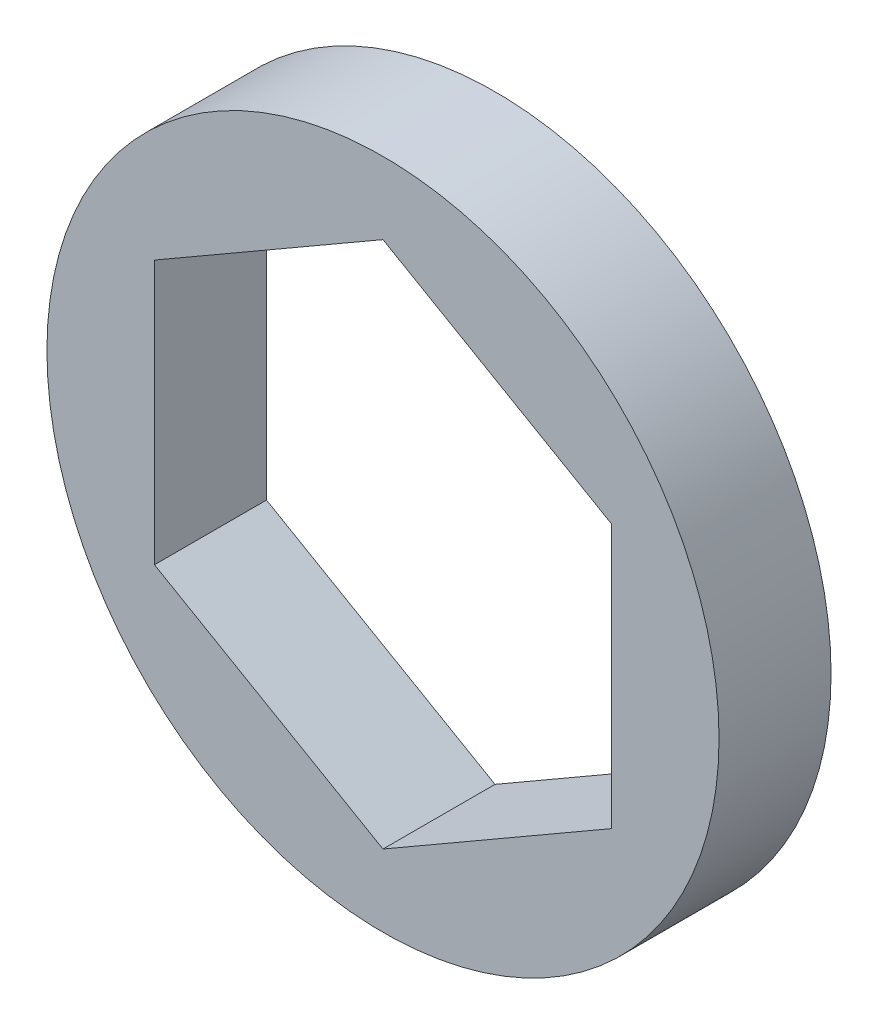
ISO-10303-21;
HEADER;
FILE_DESCRIPTION(('STEP AP214'),'2;1');
FILE_NAME('part.step','',(''),(''),'','','');
FILE_SCHEMA(('AUTOMOTIVE_DESIGN { 1 0 10303 214 1 1 1 1 }'));
ENDSEC;
DATA;
#1=APPLICATION_CONTEXT('core data for automotive mechanical design processes');
#2=APPLICATION_PROTOCOL_DEFINITION('international standard','automotive_design',2000,#1);
#3=PRODUCT_CONTEXT('',#1,'mechanical');
#4=PRODUCT('Part','Part','',(#3));
#5=PRODUCT_RELATED_PRODUCT_CATEGORY('part','',(#4));
#6=PRODUCT_DEFINITION_FORMATION('','',#4);
#7=PRODUCT_DEFINITION_CONTEXT('part definition',#1,'design');
#8=PRODUCT_DEFINITION('design','',#6,#7);
#9=PRODUCT_DEFINITION_SHAPE('','',#8);
#10=(LENGTH_UNIT() NAMED_UNIT(*) SI_UNIT(.MILLI.,.METRE.));
#11=(NAMED_UNIT(*) PLANE_ANGLE_UNIT() SI_UNIT($,.RADIAN.));
#12=(NAMED_UNIT(*) SI_UNIT($,.STERADIAN.) SOLID_ANGLE_UNIT());
#13=UNCERTAINTY_MEASURE_WITH_UNIT(LENGTH_MEASURE(1.E-05),#10,'distance_accuracy_value','');
#14=(GEOMETRIC_REPRESENTATION_CONTEXT(3) GLOBAL_UNCERTAINTY_ASSIGNED_CONTEXT((#13)) GLOBAL_UNIT_ASSIGNED_CONTEXT((#10,
#11,#12)) REPRESENTATION_CONTEXT('',''));
#15=CARTESIAN_POINT('',(0.,0.,0.));
#16=DIRECTION('',(0.,0.,1.));
#17=DIRECTION('',(1.,0.,0.));
#18=AXIS2_PLACEMENT_3D('',#15,#16,#17);
#19=CARTESIAN_POINT('',(0.,0.,-1.5875));
#20=DIRECTION('',(0.,0.,1.));
#21=DIRECTION('',(1.,0.,0.));
#22=AXIS2_PLACEMENT_3D('',#19,#20,#21);
#23=PLANE('',#22);
#24=DIRECTION('',(0.,1.,0.));
#25=VECTOR('',#24,1.);
#26=CARTESIAN_POINT('',(-6.477,3.73949769354121,-1.5875));
#27=LINE('',#26,#25);
#28=CARTESIAN_POINT('',(-6.47700000000001,-3.73949769354121,-1.5875));
#29=VERTEX_POINT('',#28);
#30=CARTESIAN_POINT('',(-6.47700000000001,3.73949769354121,-1.5875));
#31=VERTEX_POINT('',#30);
#32=EDGE_CURVE('E72',#29,#31,#27,.T.);
#33=ORIENTED_EDGE('',*,*,#32,.F.);
#34=DIRECTION('',(-0.866025403784439,0.5,0.));
#35=VECTOR('',#34,1.);
#36=CARTESIAN_POINT('',(-6.47700000000001,-3.73949769354121,-1.5875));
#37=LINE('',#36,#35);
#38=CARTESIAN_POINT('',(0.,-7.47899538708242,-1.5875));
#39=VERTEX_POINT('',#38);
#40=EDGE_CURVE('E102',#39,#29,#37,.T.);
#41=ORIENTED_EDGE('',*,*,#40,.F.);
#42=DIRECTION('',(-0.866025403784439,-0.5,0.));
#43=VECTOR('',#42,1.);
#44=CARTESIAN_POINT('',(0.,-7.47899538708242,-1.5875));
#45=LINE('',#44,#43);
#46=CARTESIAN_POINT('',(6.47700000000001,-3.73949769354122,-1.5875));
#47=VERTEX_POINT('',#46);
#48=EDGE_CURVE('E110',#47,#39,#45,.T.);
#49=ORIENTED_EDGE('',*,*,#48,.F.);
#50=DIRECTION('',(0.,-1.,0.));
#51=VECTOR('',#50,1.);
#52=CARTESIAN_POINT('',(6.47700000000001,-3.73949769354122,-1.5875));
#53=LINE('',#52,#51);
#54=CARTESIAN_POINT('',(6.47700000000001,3.73949769354121,-1.5875));
#55=VERTEX_POINT('',#54);
#56=EDGE_CURVE('E115',#55,#47,#53,.T.);
#57=ORIENTED_EDGE('',*,*,#56,.F.);
#58=DIRECTION('',(0.866025403784438,-0.500000000000001,0.));
#59=VECTOR('',#58,1.);
#60=CARTESIAN_POINT('',(6.47700000000001,3.73949769354121,-1.5875));
#61=LINE('',#60,#59);
#62=CARTESIAN_POINT('',(0.,7.47899538708242,-1.5875));
#63=VERTEX_POINT('',#62);
#64=EDGE_CURVE('E67',#63,#55,#61,.T.);
#65=ORIENTED_EDGE('',*,*,#64,.F.);
#66=DIRECTION('',(0.866025403784439,0.5,0.));
#67=VECTOR('',#66,1.);
#68=CARTESIAN_POINT('',(0.,7.47899538708242,-1.5875));
#69=LINE('',#68,#67);
#70=EDGE_CURVE('E69',#31,#63,#69,.T.);
#71=ORIENTED_EDGE('',*,*,#70,.F.);
#72=EDGE_LOOP('',(#33,#41,#49,#57,#65,#71));
#73=FACE_BOUND('',#72,.T.);
#74=CARTESIAN_POINT('',(0.,0.,-1.5875));
#75=DIRECTION('',(0.,0.,-1.));
#76=DIRECTION('',(-1.,0.,0.));
#77=AXIS2_PLACEMENT_3D('',#74,#75,#76);
#78=CIRCLE('',#77,9.525);
#79=CARTESIAN_POINT('',(-9.525,0.,-1.5875));
#80=VERTEX_POINT('',#79);
#81=EDGE_CURVE('E19',#80,#80,#78,.F.);
#82=ORIENTED_EDGE('',*,*,#81,.F.);
#83=EDGE_LOOP('',(#82));
#84=FACE_BOUND('',#83,.T.);
#85=ADVANCED_FACE('F16',(#73,#84),#23,.F.);
#86=CARTESIAN_POINT('',(0.,0.,1.5875));
#87=DIRECTION('',(0.,0.,-1.));
#88=DIRECTION('',(-1.,0.,0.));
#89=AXIS2_PLACEMENT_3D('',#86,#87,#88);
#90=CYLINDRICAL_SURFACE('',#89,9.525);
#91=ORIENTED_EDGE('',*,*,#81,.T.);
#92=EDGE_LOOP('',(#91));
#93=FACE_BOUND('',#92,.T.);
#94=CARTESIAN_POINT('',(0.,0.,1.5875));
#95=DIRECTION('',(0.,0.,-1.));
#96=DIRECTION('',(-1.,0.,0.));
#97=AXIS2_PLACEMENT_3D('',#94,#95,#96);
#98=CIRCLE('',#97,9.525);
#99=CARTESIAN_POINT('',(-9.525,0.,1.5875));
#100=VERTEX_POINT('',#99);
#101=EDGE_CURVE('E94',#100,#100,#98,.F.);
#102=ORIENTED_EDGE('',*,*,#101,.F.);
#103=EDGE_LOOP('',(#102));
#104=FACE_BOUND('',#103,.T.);
#105=ADVANCED_FACE('F152',(#93,#104),#90,.T.);
#106=CARTESIAN_POINT('',(-6.477,3.73949769354121,1.5875));
#107=DIRECTION('',(1.,0.,0.));
#108=DIRECTION('',(0.,1.,0.));
#109=AXIS2_PLACEMENT_3D('',#106,#107,#108);
#110=PLANE('',#109);
#111=DIRECTION('',(0.,1.,0.));
#112=VECTOR('',#111,1.);
#113=CARTESIAN_POINT('',(-6.47700000000001,0.,1.5875));
#114=LINE('',#113,#112);
#115=CARTESIAN_POINT('',(-6.47700000000001,-3.73949769354121,1.5875));
#116=VERTEX_POINT('',#115);
#117=CARTESIAN_POINT('',(-6.47700000000001,3.73949769354121,1.5875));
#118=VERTEX_POINT('',#117);
#119=EDGE_CURVE('E96',#116,#118,#114,.T.);
#120=ORIENTED_EDGE('',*,*,#119,.F.);
#121=DIRECTION('',(0.,0.,1.));
#122=VECTOR('',#121,1.);
#123=CARTESIAN_POINT('',(-6.47700000000001,-3.73949769354121,1.5875));
#124=LINE('',#123,#122);
#125=EDGE_CURVE('E83',#29,#116,#124,.T.);
#126=ORIENTED_EDGE('',*,*,#125,.F.);
#127=ORIENTED_EDGE('',*,*,#32,.T.);
#128=DIRECTION('',(0.,0.,1.));
#129=VECTOR('',#128,1.);
#130=CARTESIAN_POINT('',(-6.477,3.73949769354121,1.5875));
#131=LINE('',#130,#129);
#132=EDGE_CURVE('E77',#118,#31,#131,.F.);
#133=ORIENTED_EDGE('',*,*,#132,.F.);
#134=EDGE_LOOP('',(#120,#126,#127,#133));
#135=FACE_BOUND('',#134,.T.);
#136=ADVANCED_FACE('F80',(#135),#110,.T.);
#137=CARTESIAN_POINT('',(0.,7.47899538708242,1.5875));
#138=DIRECTION('',(0.5,-0.866025403784439,0.));
#139=DIRECTION('',(0.866025403784439,0.5,0.));
#140=AXIS2_PLACEMENT_3D('',#137,#138,#139);
#141=PLANE('',#140);
#142=DIRECTION('',(0.866025403784439,0.5,0.));
#143=VECTOR('',#142,1.);
#144=CARTESIAN_POINT('',(-6.477,3.73949769354121,1.5875));
#145=LINE('',#144,#143);
#146=CARTESIAN_POINT('',(0.,7.47899538708242,1.5875));
#147=VERTEX_POINT('',#146);
#148=EDGE_CURVE('E88',#118,#147,#145,.T.);
#149=ORIENTED_EDGE('',*,*,#148,.F.);
#150=ORIENTED_EDGE('',*,*,#132,.T.);
#151=ORIENTED_EDGE('',*,*,#70,.T.);
#152=DIRECTION('',(0.,0.,1.));
#153=VECTOR('',#152,1.);
#154=CARTESIAN_POINT('',(0.,7.47899538708242,1.5875));
#155=LINE('',#154,#153);
#156=EDGE_CURVE('E91',#147,#63,#155,.F.);
#157=ORIENTED_EDGE('',*,*,#156,.F.);
#158=EDGE_LOOP('',(#149,#150,#151,#157));
#159=FACE_BOUND('',#158,.T.);
#160=ADVANCED_FACE('F86',(#159),#141,.T.);
#161=CARTESIAN_POINT('',(6.47700000000001,3.73949769354121,1.5875));
#162=DIRECTION('',(-0.500000000000001,-0.866025403784438,0.));
#163=DIRECTION('',(0.866025403784438,-0.500000000000001,0.));
#164=AXIS2_PLACEMENT_3D('',#161,#162,#163);
#165=PLANE('',#164);
#166=DIRECTION('',(0.866025403784438,-0.5,0.));
#167=VECTOR('',#166,1.);
#168=CARTESIAN_POINT('',(0.,7.47899538708242,1.5875));
#169=LINE('',#168,#167);
#170=CARTESIAN_POINT('',(6.47700000000001,3.73949769354121,1.5875));
#171=VERTEX_POINT('',#170);
#172=EDGE_CURVE('E121',#147,#171,#169,.T.);
#173=ORIENTED_EDGE('',*,*,#172,.F.);
#174=ORIENTED_EDGE('',*,*,#156,.T.);
#175=ORIENTED_EDGE('',*,*,#64,.T.);
#176=DIRECTION('',(0.,0.,1.));
#177=VECTOR('',#176,1.);
#178=CARTESIAN_POINT('',(6.47700000000001,3.73949769354121,1.5875));
#179=LINE('',#178,#177);
#180=EDGE_CURVE('E112',#171,#55,#179,.F.);
#181=ORIENTED_EDGE('',*,*,#180,.F.);
#182=EDGE_LOOP('',(#173,#174,#175,#181));
#183=FACE_BOUND('',#182,.T.);
#184=ADVANCED_FACE('F119',(#183),#165,.T.);
#185=CARTESIAN_POINT('',(6.47700000000001,-3.73949769354122,1.5875));
#186=DIRECTION('',(-1.,0.,0.));
#187=DIRECTION('',(0.,-1.,0.));
#188=AXIS2_PLACEMENT_3D('',#185,#186,#187);
#189=PLANE('',#188);
#190=DIRECTION('',(0.,1.,0.));
#191=VECTOR('',#190,1.);
#192=CARTESIAN_POINT('',(6.47700000000001,0.,1.5875));
#193=LINE('',#192,#191);
#194=CARTESIAN_POINT('',(6.47700000000001,-3.73949769354122,1.5875));
#195=VERTEX_POINT('',#194);
#196=EDGE_CURVE('E125',#171,#195,#193,.F.);
#197=ORIENTED_EDGE('',*,*,#196,.F.);
#198=ORIENTED_EDGE('',*,*,#180,.T.);
#199=ORIENTED_EDGE('',*,*,#56,.T.);
#200=DIRECTION('',(0.,0.,1.));
#201=VECTOR('',#200,1.);
#202=CARTESIAN_POINT('',(6.477,-3.73949769354122,1.5875));
#203=LINE('',#202,#201);
#204=EDGE_CURVE('E107',#195,#47,#203,.F.);
#205=ORIENTED_EDGE('',*,*,#204,.F.);
#206=EDGE_LOOP('',(#197,#198,#199,#205));
#207=FACE_BOUND('',#206,.T.);
#208=ADVANCED_FACE('F133',(#207),#189,.T.);
#209=CARTESIAN_POINT('',(0.,-7.47899538708242,1.5875));
#210=DIRECTION('',(-0.5,0.866025403784439,0.));
#211=DIRECTION('',(-0.866025403784439,-0.5,0.));
#212=AXIS2_PLACEMENT_3D('',#209,#210,#211);
#213=PLANE('',#212);
#214=DIRECTION('',(-0.866025403784439,-0.5,0.));
#215=VECTOR('',#214,1.);
#216=CARTESIAN_POINT('',(6.47700000000001,-3.73949769354122,1.5875));
#217=LINE('',#216,#215);
#218=CARTESIAN_POINT('',(0.,-7.47899538708242,1.5875));
#219=VERTEX_POINT('',#218);
#220=EDGE_CURVE('E25',#195,#219,#217,.T.);
#221=ORIENTED_EDGE('',*,*,#220,.F.);
#222=ORIENTED_EDGE('',*,*,#204,.T.);
#223=ORIENTED_EDGE('',*,*,#48,.T.);
#224=DIRECTION('',(0.,0.,1.));
#225=VECTOR('',#224,1.);
#226=CARTESIAN_POINT('',(0.,-7.47899538708242,1.5875));
#227=LINE('',#226,#225);
#228=EDGE_CURVE('E34',#219,#39,#227,.F.);
#229=ORIENTED_EDGE('',*,*,#228,.F.);
#230=EDGE_LOOP('',(#221,#222,#223,#229));
#231=FACE_BOUND('',#230,.T.);
#232=ADVANCED_FACE('F131',(#231),#213,.T.);
#233=CARTESIAN_POINT('',(-6.47700000000001,-3.73949769354121,1.5875));
#234=DIRECTION('',(0.5,0.866025403784439,0.));
#235=DIRECTION('',(-0.866025403784439,0.5,0.));
#236=AXIS2_PLACEMENT_3D('',#233,#234,#235);
#237=PLANE('',#236);
#238=DIRECTION('',(-0.866025403784438,0.5,0.));
#239=VECTOR('',#238,1.);
#240=CARTESIAN_POINT('',(0.,-7.47899538708242,1.5875));
#241=LINE('',#240,#239);
#242=EDGE_CURVE('E11',#219,#116,#241,.T.);
#243=ORIENTED_EDGE('',*,*,#242,.F.);
#244=ORIENTED_EDGE('',*,*,#228,.T.);
#245=ORIENTED_EDGE('',*,*,#40,.T.);
#246=ORIENTED_EDGE('',*,*,#125,.T.);
#247=EDGE_LOOP('',(#243,#244,#245,#246));
#248=FACE_BOUND('',#247,.T.);
#249=ADVANCED_FACE('F134',(#248),#237,.T.);
#250=CARTESIAN_POINT('',(0.,0.,1.5875));
#251=DIRECTION('',(0.,0.,1.));
#252=DIRECTION('',(1.,0.,0.));
#253=AXIS2_PLACEMENT_3D('',#250,#251,#252);
#254=PLANE('',#253);
#255=ORIENTED_EDGE('',*,*,#220,.T.);
#256=ORIENTED_EDGE('',*,*,#242,.T.);
#257=ORIENTED_EDGE('',*,*,#119,.T.);
#258=ORIENTED_EDGE('',*,*,#148,.T.);
#259=ORIENTED_EDGE('',*,*,#172,.T.);
#260=ORIENTED_EDGE('',*,*,#196,.T.);
#261=EDGE_LOOP('',(#255,#256,#257,#258,#259,#260));
#262=FACE_BOUND('',#261,.T.);
#263=ORIENTED_EDGE('',*,*,#101,.T.);
#264=EDGE_LOOP('',(#263));
#265=FACE_BOUND('',#264,.T.);
#266=ADVANCED_FACE('F128',(#262,#265),#254,.T.);
#267=CLOSED_SHELL('',(#85,#105,#136,#160,#184,#208,#232,#249,#266));
#268=MANIFOLD_SOLID_BREP('B1',#267);
#269=ADVANCED_BREP_SHAPE_REPRESENTATION('',(#18,#268),#14);
#270=SHAPE_DEFINITION_REPRESENTATION(#9,#269);
ENDSEC;
END-ISO-10303-21;
